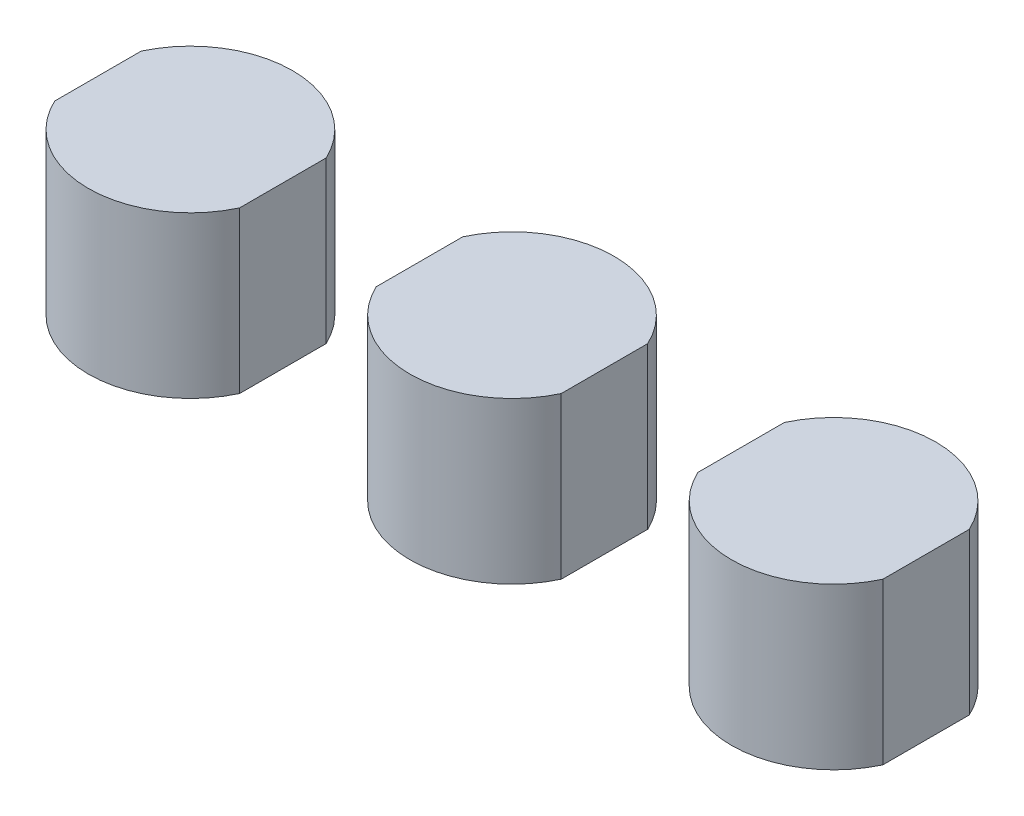
ISO-10303-21;
HEADER;
FILE_DESCRIPTION(('STEP AP214'),'2;1');
FILE_NAME('part.step','',(''),(''),'','','');
FILE_SCHEMA(('AUTOMOTIVE_DESIGN { 1 0 10303 214 1 1 1 1 }'));
ENDSEC;
DATA;
#1=APPLICATION_CONTEXT('core data for automotive mechanical design processes');
#2=APPLICATION_PROTOCOL_DEFINITION('international standard','automotive_design',2000,#1);
#3=PRODUCT_CONTEXT('',#1,'mechanical');
#4=PRODUCT('Part','Part','',(#3));
#5=PRODUCT_RELATED_PRODUCT_CATEGORY('part','',(#4));
#6=PRODUCT_DEFINITION_FORMATION('','',#4);
#7=PRODUCT_DEFINITION_CONTEXT('part definition',#1,'design');
#8=PRODUCT_DEFINITION('design','',#6,#7);
#9=PRODUCT_DEFINITION_SHAPE('','',#8);
#10=(LENGTH_UNIT() NAMED_UNIT(*) SI_UNIT(.MILLI.,.METRE.));
#11=(NAMED_UNIT(*) PLANE_ANGLE_UNIT() SI_UNIT($,.RADIAN.));
#12=(NAMED_UNIT(*) SI_UNIT($,.STERADIAN.) SOLID_ANGLE_UNIT());
#13=UNCERTAINTY_MEASURE_WITH_UNIT(LENGTH_MEASURE(1.E-05),#10,'distance_accuracy_value','');
#14=(GEOMETRIC_REPRESENTATION_CONTEXT(3) GLOBAL_UNCERTAINTY_ASSIGNED_CONTEXT((#13)) GLOBAL_UNIT_ASSIGNED_CONTEXT((#10,
#11,#12)) REPRESENTATION_CONTEXT('',''));
#15=CARTESIAN_POINT('',(0.,0.,0.));
#16=DIRECTION('',(0.,0.,1.));
#17=DIRECTION('',(1.,0.,0.));
#18=AXIS2_PLACEMENT_3D('',#15,#16,#17);
#19=CARTESIAN_POINT('',(-14.2479221145746,10.,0.));
#20=DIRECTION('',(-1.,0.,0.));
#21=DIRECTION('',(0.,0.,1.));
#22=AXIS2_PLACEMENT_3D('',#19,#20,#21);
#23=PLANE('',#22);
#24=DIRECTION('',(0.,0.,-1.));
#25=VECTOR('',#24,1.);
#26=CARTESIAN_POINT('',(-14.2479221145746,0.,0.));
#27=LINE('',#26,#25);
#28=CARTESIAN_POINT('',(-14.2479221145746,0.,2.69));
#29=VERTEX_POINT('',#28);
#30=CARTESIAN_POINT('',(-14.2479221145746,0.,-2.69));
#31=VERTEX_POINT('',#30);
#32=EDGE_CURVE('P0_E84',#29,#31,#27,.T.);
#33=ORIENTED_EDGE('',*,*,#32,.T.);
#34=DIRECTION('',(0.,-1.,0.));
#35=VECTOR('',#34,1.);
#36=CARTESIAN_POINT('',(-14.2479221145746,10.,-2.69));
#37=LINE('',#36,#35);
#38=CARTESIAN_POINT('',(-14.2479221145746,10.,-2.69));
#39=VERTEX_POINT('',#38);
#40=EDGE_CURVE('P0_E11',#39,#31,#37,.T.);
#41=ORIENTED_EDGE('',*,*,#40,.F.);
#42=DIRECTION('',(0.,0.,-1.));
#43=VECTOR('',#42,1.);
#44=CARTESIAN_POINT('',(-14.2479221145746,10.,0.));
#45=LINE('',#44,#43);
#46=CARTESIAN_POINT('',(-14.2479221145746,10.,2.69));
#47=VERTEX_POINT('',#46);
#48=EDGE_CURVE('P0_E65',#47,#39,#45,.T.);
#49=ORIENTED_EDGE('',*,*,#48,.F.);
#50=DIRECTION('',(0.,-1.,0.));
#51=VECTOR('',#50,1.);
#52=CARTESIAN_POINT('',(-14.2479221145746,10.,2.69));
#53=LINE('',#52,#51);
#54=EDGE_CURVE('P0_E81',#47,#29,#53,.T.);
#55=ORIENTED_EDGE('',*,*,#54,.T.);
#56=EDGE_LOOP('',(#33,#41,#49,#55));
#57=FACE_BOUND('',#56,.T.);
#58=ADVANCED_FACE('P0_F17',(#57),#23,.F.);
#59=CARTESIAN_POINT('',(-20.,10.,0.));
#60=DIRECTION('',(0.,-1.,0.));
#61=DIRECTION('',(0.,0.,-1.));
#62=AXIS2_PLACEMENT_3D('',#59,#60,#61);
#63=CYLINDRICAL_SURFACE('',#62,6.35);
#64=CARTESIAN_POINT('',(-20.,0.,0.));
#65=DIRECTION('',(0.,1.,0.));
#66=DIRECTION('',(0.,0.,1.));
#67=AXIS2_PLACEMENT_3D('',#64,#65,#66);
#68=CIRCLE('',#67,6.35);
#69=CARTESIAN_POINT('',(-25.7520778854254,0.,-2.69));
#70=VERTEX_POINT('',#69);
#71=EDGE_CURVE('P0_E71',#31,#70,#68,.T.);
#72=ORIENTED_EDGE('',*,*,#71,.T.);
#73=DIRECTION('',(0.,-1.,0.));
#74=VECTOR('',#73,1.);
#75=CARTESIAN_POINT('',(-25.7520778854254,10.,-2.69));
#76=LINE('',#75,#74);
#77=CARTESIAN_POINT('',(-25.7520778854254,10.,-2.69));
#78=VERTEX_POINT('',#77);
#79=EDGE_CURVE('P0_E26',#78,#70,#76,.T.);
#80=ORIENTED_EDGE('',*,*,#79,.F.);
#81=CARTESIAN_POINT('',(-20.,10.,0.));
#82=DIRECTION('',(0.,1.,0.));
#83=DIRECTION('',(0.,0.,1.));
#84=AXIS2_PLACEMENT_3D('',#81,#82,#83);
#85=CIRCLE('',#84,6.35);
#86=EDGE_CURVE('P0_E60',#39,#78,#85,.T.);
#87=ORIENTED_EDGE('',*,*,#86,.F.);
#88=ORIENTED_EDGE('',*,*,#40,.T.);
#89=EDGE_LOOP('',(#72,#80,#87,#88));
#90=FACE_BOUND('',#89,.T.);
#91=ADVANCED_FACE('P0_F70',(#90),#63,.T.);
#92=CARTESIAN_POINT('',(-25.7520778854254,10.,0.));
#93=DIRECTION('',(-1.,0.,0.));
#94=DIRECTION('',(0.,0.,1.));
#95=AXIS2_PLACEMENT_3D('',#92,#93,#94);
#96=PLANE('',#95);
#97=DIRECTION('',(0.,0.,-1.));
#98=VECTOR('',#97,1.);
#99=CARTESIAN_POINT('',(-25.7520778854254,0.,0.));
#100=LINE('',#99,#98);
#101=CARTESIAN_POINT('',(-25.7520778854254,0.,2.69));
#102=VERTEX_POINT('',#101);
#103=EDGE_CURVE('P0_E90',#102,#70,#100,.T.);
#104=ORIENTED_EDGE('',*,*,#103,.F.);
#105=DIRECTION('',(0.,-1.,0.));
#106=VECTOR('',#105,1.);
#107=CARTESIAN_POINT('',(-25.7520778854254,10.,2.69));
#108=LINE('',#107,#106);
#109=CARTESIAN_POINT('',(-25.7520778854254,10.,2.69));
#110=VERTEX_POINT('',#109);
#111=EDGE_CURVE('P0_E50',#110,#102,#108,.T.);
#112=ORIENTED_EDGE('',*,*,#111,.F.);
#113=DIRECTION('',(0.,0.,-1.));
#114=VECTOR('',#113,1.);
#115=CARTESIAN_POINT('',(-25.7520778854254,10.,0.));
#116=LINE('',#115,#114);
#117=EDGE_CURVE('P0_E63',#110,#78,#116,.T.);
#118=ORIENTED_EDGE('',*,*,#117,.T.);
#119=ORIENTED_EDGE('',*,*,#79,.T.);
#120=EDGE_LOOP('',(#104,#112,#118,#119));
#121=FACE_BOUND('',#120,.T.);
#122=ADVANCED_FACE('P0_F76',(#121),#96,.T.);
#123=EDGE_CURVE('P0_E53',#102,#29,#68,.T.);
#124=ORIENTED_EDGE('',*,*,#123,.T.);
#125=ORIENTED_EDGE('',*,*,#54,.F.);
#126=EDGE_CURVE('P0_E34',#110,#47,#85,.T.);
#127=ORIENTED_EDGE('',*,*,#126,.F.);
#128=ORIENTED_EDGE('',*,*,#111,.T.);
#129=EDGE_LOOP('',(#124,#125,#127,#128));
#130=FACE_BOUND('',#129,.T.);
#131=ADVANCED_FACE('P0_F110',(#130),#63,.T.);
#132=CARTESIAN_POINT('',(-20.,10.,0.));
#133=DIRECTION('',(0.,1.,0.));
#134=DIRECTION('',(0.,0.,1.));
#135=AXIS2_PLACEMENT_3D('',#132,#133,#134);
#136=PLANE('',#135);
#137=ORIENTED_EDGE('',*,*,#48,.T.);
#138=ORIENTED_EDGE('',*,*,#86,.T.);
#139=ORIENTED_EDGE('',*,*,#117,.F.);
#140=ORIENTED_EDGE('',*,*,#126,.T.);
#141=EDGE_LOOP('',(#137,#138,#139,#140));
#142=FACE_BOUND('',#141,.T.);
#143=ADVANCED_FACE('P0_F61',(#142),#136,.T.);
#144=CARTESIAN_POINT('',(-20.,0.,0.));
#145=DIRECTION('',(0.,1.,0.));
#146=DIRECTION('',(0.,0.,1.));
#147=AXIS2_PLACEMENT_3D('',#144,#145,#146);
#148=PLANE('',#147);
#149=ORIENTED_EDGE('',*,*,#32,.F.);
#150=ORIENTED_EDGE('',*,*,#123,.F.);
#151=ORIENTED_EDGE('',*,*,#103,.T.);
#152=ORIENTED_EDGE('',*,*,#71,.F.);
#153=EDGE_LOOP('',(#149,#150,#151,#152));
#154=FACE_BOUND('',#153,.T.);
#155=ADVANCED_FACE('P0_F101',(#154),#148,.F.);
#156=CLOSED_SHELL('',(#58,#91,#122,#131,#143,#155));
#157=MANIFOLD_SOLID_BREP('P0_B1',#156);
#158=CARTESIAN_POINT('',(25.7520778854254,10.,0.));
#159=DIRECTION('',(-1.,0.,0.));
#160=DIRECTION('',(0.,0.,1.));
#161=AXIS2_PLACEMENT_3D('',#158,#159,#160);
#162=PLANE('',#161);
#163=DIRECTION('',(0.,0.,-1.));
#164=VECTOR('',#163,1.);
#165=CARTESIAN_POINT('',(25.7520778854254,0.,0.));
#166=LINE('',#165,#164);
#167=CARTESIAN_POINT('',(25.7520778854254,0.,2.69));
#168=VERTEX_POINT('',#167);
#169=CARTESIAN_POINT('',(25.7520778854254,0.,-2.69));
#170=VERTEX_POINT('',#169);
#171=EDGE_CURVE('P1_E78',#168,#170,#166,.T.);
#172=ORIENTED_EDGE('',*,*,#171,.T.);
#173=DIRECTION('',(0.,-1.,0.));
#174=VECTOR('',#173,1.);
#175=CARTESIAN_POINT('',(25.7520778854254,10.,-2.69));
#176=LINE('',#175,#174);
#177=CARTESIAN_POINT('',(25.7520778854254,10.,-2.69));
#178=VERTEX_POINT('',#177);
#179=EDGE_CURVE('P1_E11',#178,#170,#176,.T.);
#180=ORIENTED_EDGE('',*,*,#179,.F.);
#181=DIRECTION('',(0.,0.,-1.));
#182=VECTOR('',#181,1.);
#183=CARTESIAN_POINT('',(25.7520778854254,10.,0.));
#184=LINE('',#183,#182);
#185=CARTESIAN_POINT('',(25.7520778854254,10.,2.69));
#186=VERTEX_POINT('',#185);
#187=EDGE_CURVE('P1_E64',#186,#178,#184,.T.);
#188=ORIENTED_EDGE('',*,*,#187,.F.);
#189=DIRECTION('',(0.,-1.,0.));
#190=VECTOR('',#189,1.);
#191=CARTESIAN_POINT('',(25.7520778854254,10.,2.69));
#192=LINE('',#191,#190);
#193=EDGE_CURVE('P1_E75',#186,#168,#192,.T.);
#194=ORIENTED_EDGE('',*,*,#193,.T.);
#195=EDGE_LOOP('',(#172,#180,#188,#194));
#196=FACE_BOUND('',#195,.T.);
#197=ADVANCED_FACE('P1_F17',(#196),#162,.F.);
#198=CARTESIAN_POINT('',(20.,10.,0.));
#199=DIRECTION('',(0.,-1.,0.));
#200=DIRECTION('',(0.,0.,-1.));
#201=AXIS2_PLACEMENT_3D('',#198,#199,#200);
#202=CYLINDRICAL_SURFACE('',#201,6.35);
#203=CARTESIAN_POINT('',(20.,0.,0.));
#204=DIRECTION('',(0.,1.,0.));
#205=DIRECTION('',(0.,0.,1.));
#206=AXIS2_PLACEMENT_3D('',#203,#204,#205);
#207=CIRCLE('',#206,6.35);
#208=CARTESIAN_POINT('',(14.2479221145746,0.,-2.69));
#209=VERTEX_POINT('',#208);
#210=EDGE_CURVE('P1_E69',#170,#209,#207,.T.);
#211=ORIENTED_EDGE('',*,*,#210,.T.);
#212=DIRECTION('',(0.,-1.,0.));
#213=VECTOR('',#212,1.);
#214=CARTESIAN_POINT('',(14.2479221145746,10.,-2.69));
#215=LINE('',#214,#213);
#216=CARTESIAN_POINT('',(14.2479221145746,10.,-2.69));
#217=VERTEX_POINT('',#216);
#218=EDGE_CURVE('P1_E25',#217,#209,#215,.T.);
#219=ORIENTED_EDGE('',*,*,#218,.F.);
#220=CARTESIAN_POINT('',(20.,10.,0.));
#221=DIRECTION('',(0.,1.,0.));
#222=DIRECTION('',(0.,0.,1.));
#223=AXIS2_PLACEMENT_3D('',#220,#221,#222);
#224=CIRCLE('',#223,6.35);
#225=EDGE_CURVE('P1_E59',#178,#217,#224,.T.);
#226=ORIENTED_EDGE('',*,*,#225,.F.);
#227=ORIENTED_EDGE('',*,*,#179,.T.);
#228=EDGE_LOOP('',(#211,#219,#226,#227));
#229=FACE_BOUND('',#228,.T.);
#230=ADVANCED_FACE('P1_F68',(#229),#202,.T.);
#231=CARTESIAN_POINT('',(14.2479221145746,10.,0.));
#232=DIRECTION('',(-1.,0.,0.));
#233=DIRECTION('',(0.,0.,1.));
#234=AXIS2_PLACEMENT_3D('',#231,#232,#233);
#235=PLANE('',#234);
#236=DIRECTION('',(0.,0.,-1.));
#237=VECTOR('',#236,1.);
#238=CARTESIAN_POINT('',(14.2479221145746,0.,0.));
#239=LINE('',#238,#237);
#240=CARTESIAN_POINT('',(14.2479221145746,0.,2.69));
#241=VERTEX_POINT('',#240);
#242=EDGE_CURVE('P1_E82',#241,#209,#239,.T.);
#243=ORIENTED_EDGE('',*,*,#242,.F.);
#244=DIRECTION('',(0.,-1.,0.));
#245=VECTOR('',#244,1.);
#246=CARTESIAN_POINT('',(14.2479221145746,10.,2.69));
#247=LINE('',#246,#245);
#248=CARTESIAN_POINT('',(14.2479221145746,10.,2.69));
#249=VERTEX_POINT('',#248);
#250=EDGE_CURVE('P1_E49',#249,#241,#247,.T.);
#251=ORIENTED_EDGE('',*,*,#250,.F.);
#252=DIRECTION('',(0.,0.,-1.));
#253=VECTOR('',#252,1.);
#254=CARTESIAN_POINT('',(14.2479221145746,10.,0.));
#255=LINE('',#254,#253);
#256=EDGE_CURVE('P1_E62',#249,#217,#255,.T.);
#257=ORIENTED_EDGE('',*,*,#256,.T.);
#258=ORIENTED_EDGE('',*,*,#218,.T.);
#259=EDGE_LOOP('',(#243,#251,#257,#258));
#260=FACE_BOUND('',#259,.T.);
#261=ADVANCED_FACE('P1_F73',(#260),#235,.T.);
#262=EDGE_CURVE('P1_E52',#241,#168,#207,.T.);
#263=ORIENTED_EDGE('',*,*,#262,.T.);
#264=ORIENTED_EDGE('',*,*,#193,.F.);
#265=EDGE_CURVE('P1_E33',#249,#186,#224,.T.);
#266=ORIENTED_EDGE('',*,*,#265,.F.);
#267=ORIENTED_EDGE('',*,*,#250,.T.);
#268=EDGE_LOOP('',(#263,#264,#266,#267));
#269=FACE_BOUND('',#268,.T.);
#270=ADVANCED_FACE('P1_F95',(#269),#202,.T.);
#271=CARTESIAN_POINT('',(20.,10.,0.));
#272=DIRECTION('',(0.,1.,0.));
#273=DIRECTION('',(0.,0.,1.));
#274=AXIS2_PLACEMENT_3D('',#271,#272,#273);
#275=PLANE('',#274);
#276=ORIENTED_EDGE('',*,*,#187,.T.);
#277=ORIENTED_EDGE('',*,*,#225,.T.);
#278=ORIENTED_EDGE('',*,*,#256,.F.);
#279=ORIENTED_EDGE('',*,*,#265,.T.);
#280=EDGE_LOOP('',(#276,#277,#278,#279));
#281=FACE_BOUND('',#280,.T.);
#282=ADVANCED_FACE('P1_F60',(#281),#275,.T.);
#283=CARTESIAN_POINT('',(20.,0.,0.));
#284=DIRECTION('',(0.,1.,0.));
#285=DIRECTION('',(0.,0.,1.));
#286=AXIS2_PLACEMENT_3D('',#283,#284,#285);
#287=PLANE('',#286);
#288=ORIENTED_EDGE('',*,*,#171,.F.);
#289=ORIENTED_EDGE('',*,*,#262,.F.);
#290=ORIENTED_EDGE('',*,*,#242,.T.);
#291=ORIENTED_EDGE('',*,*,#210,.F.);
#292=EDGE_LOOP('',(#288,#289,#290,#291));
#293=FACE_BOUND('',#292,.T.);
#294=ADVANCED_FACE('P1_F88',(#293),#287,.F.);
#295=CLOSED_SHELL('',(#197,#230,#261,#270,#282,#294));
#296=MANIFOLD_SOLID_BREP('P1_B1',#295);
#297=CARTESIAN_POINT('',(5.7520778854254,10.,0.));
#298=DIRECTION('',(-1.,0.,0.));
#299=DIRECTION('',(0.,0.,1.));
#300=AXIS2_PLACEMENT_3D('',#297,#298,#299);
#301=PLANE('',#300);
#302=DIRECTION('',(0.,0.,-1.));
#303=VECTOR('',#302,1.);
#304=CARTESIAN_POINT('',(5.7520778854254,0.,0.));
#305=LINE('',#304,#303);
#306=CARTESIAN_POINT('',(5.7520778854254,0.,2.69));
#307=VERTEX_POINT('',#306);
#308=CARTESIAN_POINT('',(5.7520778854254,0.,-2.69));
#309=VERTEX_POINT('',#308);
#310=EDGE_CURVE('P2_E77',#307,#309,#305,.T.);
#311=ORIENTED_EDGE('',*,*,#310,.T.);
#312=DIRECTION('',(0.,-1.,0.));
#313=VECTOR('',#312,1.);
#314=CARTESIAN_POINT('',(5.7520778854254,10.,-2.69));
#315=LINE('',#314,#313);
#316=CARTESIAN_POINT('',(5.7520778854254,10.,-2.69));
#317=VERTEX_POINT('',#316);
#318=EDGE_CURVE('P2_E10',#317,#309,#315,.T.);
#319=ORIENTED_EDGE('',*,*,#318,.F.);
#320=DIRECTION('',(0.,0.,-1.));
#321=VECTOR('',#320,1.);
#322=CARTESIAN_POINT('',(5.7520778854254,10.,0.));
#323=LINE('',#322,#321);
#324=CARTESIAN_POINT('',(5.7520778854254,10.,2.69));
#325=VERTEX_POINT('',#324);
#326=EDGE_CURVE('P2_E63',#325,#317,#323,.T.);
#327=ORIENTED_EDGE('',*,*,#326,.F.);
#328=DIRECTION('',(0.,-1.,0.));
#329=VECTOR('',#328,1.);
#330=CARTESIAN_POINT('',(5.7520778854254,10.,2.69));
#331=LINE('',#330,#329);
#332=EDGE_CURVE('P2_E74',#325,#307,#331,.T.);
#333=ORIENTED_EDGE('',*,*,#332,.T.);
#334=EDGE_LOOP('',(#311,#319,#327,#333));
#335=FACE_BOUND('',#334,.T.);
#336=ADVANCED_FACE('P2_F16',(#335),#301,.F.);
#337=CARTESIAN_POINT('',(0.,10.,0.));
#338=DIRECTION('',(0.,-1.,0.));
#339=DIRECTION('',(0.,0.,-1.));
#340=AXIS2_PLACEMENT_3D('',#337,#338,#339);
#341=CYLINDRICAL_SURFACE('',#340,6.35);
#342=CARTESIAN_POINT('',(0.,0.,0.));
#343=DIRECTION('',(0.,1.,0.));
#344=DIRECTION('',(0.,0.,1.));
#345=AXIS2_PLACEMENT_3D('',#342,#343,#344);
#346=CIRCLE('',#345,6.35);
#347=CARTESIAN_POINT('',(-5.7520778854254,0.,-2.69));
#348=VERTEX_POINT('',#347);
#349=EDGE_CURVE('P2_E68',#309,#348,#346,.T.);
#350=ORIENTED_EDGE('',*,*,#349,.T.);
#351=DIRECTION('',(0.,-1.,0.));
#352=VECTOR('',#351,1.);
#353=CARTESIAN_POINT('',(-5.7520778854254,10.,-2.69));
#354=LINE('',#353,#352);
#355=CARTESIAN_POINT('',(-5.7520778854254,10.,-2.69));
#356=VERTEX_POINT('',#355);
#357=EDGE_CURVE('P2_E24',#356,#348,#354,.T.);
#358=ORIENTED_EDGE('',*,*,#357,.F.);
#359=CARTESIAN_POINT('',(0.,10.,0.));
#360=DIRECTION('',(0.,1.,0.));
#361=DIRECTION('',(0.,0.,1.));
#362=AXIS2_PLACEMENT_3D('',#359,#360,#361);
#363=CIRCLE('',#362,6.35);
#364=EDGE_CURVE('P2_E58',#317,#356,#363,.T.);
#365=ORIENTED_EDGE('',*,*,#364,.F.);
#366=ORIENTED_EDGE('',*,*,#318,.T.);
#367=EDGE_LOOP('',(#350,#358,#365,#366));
#368=FACE_BOUND('',#367,.T.);
#369=ADVANCED_FACE('P2_F67',(#368),#341,.T.);
#370=CARTESIAN_POINT('',(-5.7520778854254,10.,0.));
#371=DIRECTION('',(-1.,0.,0.));
#372=DIRECTION('',(0.,0.,1.));
#373=AXIS2_PLACEMENT_3D('',#370,#371,#372);
#374=PLANE('',#373);
#375=DIRECTION('',(0.,0.,-1.));
#376=VECTOR('',#375,1.);
#377=CARTESIAN_POINT('',(-5.7520778854254,0.,0.));
#378=LINE('',#377,#376);
#379=CARTESIAN_POINT('',(-5.7520778854254,0.,2.69));
#380=VERTEX_POINT('',#379);
#381=EDGE_CURVE('P2_E81',#380,#348,#378,.T.);
#382=ORIENTED_EDGE('',*,*,#381,.F.);
#383=DIRECTION('',(0.,-1.,0.));
#384=VECTOR('',#383,1.);
#385=CARTESIAN_POINT('',(-5.7520778854254,10.,2.69));
#386=LINE('',#385,#384);
#387=CARTESIAN_POINT('',(-5.7520778854254,10.,2.69));
#388=VERTEX_POINT('',#387);
#389=EDGE_CURVE('P2_E48',#388,#380,#386,.T.);
#390=ORIENTED_EDGE('',*,*,#389,.F.);
#391=DIRECTION('',(0.,0.,-1.));
#392=VECTOR('',#391,1.);
#393=CARTESIAN_POINT('',(-5.7520778854254,10.,0.));
#394=LINE('',#393,#392);
#395=EDGE_CURVE('P2_E61',#388,#356,#394,.T.);
#396=ORIENTED_EDGE('',*,*,#395,.T.);
#397=ORIENTED_EDGE('',*,*,#357,.T.);
#398=EDGE_LOOP('',(#382,#390,#396,#397));
#399=FACE_BOUND('',#398,.T.);
#400=ADVANCED_FACE('P2_F72',(#399),#374,.T.);
#401=EDGE_CURVE('P2_E51',#380,#307,#346,.T.);
#402=ORIENTED_EDGE('',*,*,#401,.T.);
#403=ORIENTED_EDGE('',*,*,#332,.F.);
#404=EDGE_CURVE('P2_E32',#388,#325,#363,.T.);
#405=ORIENTED_EDGE('',*,*,#404,.F.);
#406=ORIENTED_EDGE('',*,*,#389,.T.);
#407=EDGE_LOOP('',(#402,#403,#405,#406));
#408=FACE_BOUND('',#407,.T.);
#409=ADVANCED_FACE('P2_F95',(#408),#341,.T.);
#410=CARTESIAN_POINT('',(0.,10.,0.));
#411=DIRECTION('',(0.,1.,0.));
#412=DIRECTION('',(0.,0.,1.));
#413=AXIS2_PLACEMENT_3D('',#410,#411,#412);
#414=PLANE('',#413);
#415=ORIENTED_EDGE('',*,*,#326,.T.);
#416=ORIENTED_EDGE('',*,*,#364,.T.);
#417=ORIENTED_EDGE('',*,*,#395,.F.);
#418=ORIENTED_EDGE('',*,*,#404,.T.);
#419=EDGE_LOOP('',(#415,#416,#417,#418));
#420=FACE_BOUND('',#419,.T.);
#421=ADVANCED_FACE('P2_F59',(#420),#414,.T.);
#422=CARTESIAN_POINT('',(0.,0.,0.));
#423=DIRECTION('',(0.,1.,0.));
#424=DIRECTION('',(0.,0.,1.));
#425=AXIS2_PLACEMENT_3D('',#422,#423,#424);
#426=PLANE('',#425);
#427=ORIENTED_EDGE('',*,*,#310,.F.);
#428=ORIENTED_EDGE('',*,*,#401,.F.);
#429=ORIENTED_EDGE('',*,*,#381,.T.);
#430=ORIENTED_EDGE('',*,*,#349,.F.);
#431=EDGE_LOOP('',(#427,#428,#429,#430));
#432=FACE_BOUND('',#431,.T.);
#433=ADVANCED_FACE('P2_F87',(#432),#426,.F.);
#434=CLOSED_SHELL('',(#336,#369,#400,#409,#421,#433));
#435=MANIFOLD_SOLID_BREP('P2_B1',#434);
#436=ADVANCED_BREP_SHAPE_REPRESENTATION('',(#18,#157,#296,#435),#14);
#437=SHAPE_DEFINITION_REPRESENTATION(#9,#436);
ENDSEC;
END-ISO-10303-21;
